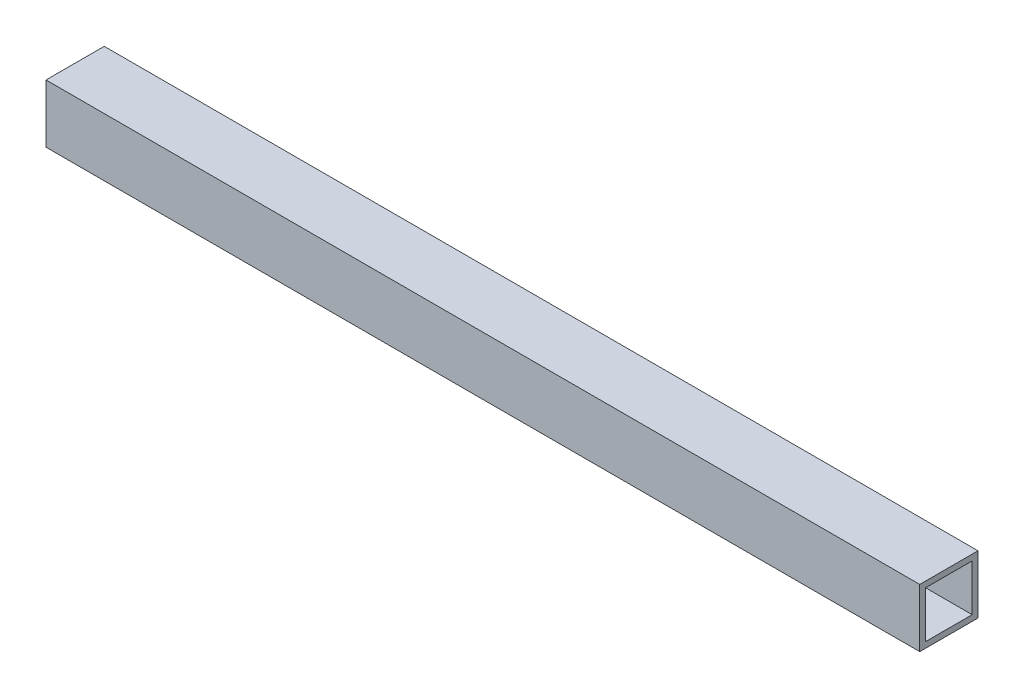
ISO-10303-21;
HEADER;
FILE_DESCRIPTION(('STEP AP214'),'2;1');
FILE_NAME('part.step','',(''),(''),'','','');
FILE_SCHEMA(('AUTOMOTIVE_DESIGN { 1 0 10303 214 1 1 1 1 }'));
ENDSEC;
DATA;
#1=APPLICATION_CONTEXT('core data for automotive mechanical design processes');
#2=APPLICATION_PROTOCOL_DEFINITION('international standard','automotive_design',2000,#1);
#3=PRODUCT_CONTEXT('',#1,'mechanical');
#4=PRODUCT('Part','Part','',(#3));
#5=PRODUCT_RELATED_PRODUCT_CATEGORY('part','',(#4));
#6=PRODUCT_DEFINITION_FORMATION('','',#4);
#7=PRODUCT_DEFINITION_CONTEXT('part definition',#1,'design');
#8=PRODUCT_DEFINITION('design','',#6,#7);
#9=PRODUCT_DEFINITION_SHAPE('','',#8);
#10=(LENGTH_UNIT() NAMED_UNIT(*) SI_UNIT(.MILLI.,.METRE.));
#11=(NAMED_UNIT(*) PLANE_ANGLE_UNIT() SI_UNIT($,.RADIAN.));
#12=(NAMED_UNIT(*) SI_UNIT($,.STERADIAN.) SOLID_ANGLE_UNIT());
#13=UNCERTAINTY_MEASURE_WITH_UNIT(LENGTH_MEASURE(1.E-05),#10,'distance_accuracy_value','');
#14=(GEOMETRIC_REPRESENTATION_CONTEXT(3) GLOBAL_UNCERTAINTY_ASSIGNED_CONTEXT((#13)) GLOBAL_UNIT_ASSIGNED_CONTEXT((#10,
#11,#12)) REPRESENTATION_CONTEXT('',''));
#15=CARTESIAN_POINT('',(0.,0.,0.));
#16=DIRECTION('',(0.,0.,1.));
#17=DIRECTION('',(1.,0.,0.));
#18=AXIS2_PLACEMENT_3D('',#15,#16,#17);
#19=CARTESIAN_POINT('',(150.,0.,0.));
#20=DIRECTION('',(-1.,0.,0.));
#21=DIRECTION('',(0.,0.,1.));
#22=AXIS2_PLACEMENT_3D('',#19,#20,#21);
#23=PLANE('',#22);
#24=DIRECTION('',(0.,1.,0.));
#25=VECTOR('',#24,1.);
#26=CARTESIAN_POINT('',(150.,-5.,-5.));
#27=LINE('',#26,#25);
#28=CARTESIAN_POINT('',(150.,-5.,-5.));
#29=VERTEX_POINT('',#28);
#30=CARTESIAN_POINT('',(150.,5.,-5.));
#31=VERTEX_POINT('',#30);
#32=EDGE_CURVE('E153',#29,#31,#27,.T.);
#33=ORIENTED_EDGE('',*,*,#32,.T.);
#34=DIRECTION('',(0.,0.,1.));
#35=VECTOR('',#34,1.);
#36=CARTESIAN_POINT('',(150.,5.,5.));
#37=LINE('',#36,#35);
#38=CARTESIAN_POINT('',(150.,5.,5.));
#39=VERTEX_POINT('',#38);
#40=EDGE_CURVE('E157',#31,#39,#37,.T.);
#41=ORIENTED_EDGE('',*,*,#40,.T.);
#42=DIRECTION('',(0.,-1.,0.));
#43=VECTOR('',#42,1.);
#44=CARTESIAN_POINT('',(150.,-5.,5.));
#45=LINE('',#44,#43);
#46=CARTESIAN_POINT('',(150.,-5.,5.));
#47=VERTEX_POINT('',#46);
#48=EDGE_CURVE('E161',#39,#47,#45,.T.);
#49=ORIENTED_EDGE('',*,*,#48,.T.);
#50=DIRECTION('',(0.,0.,-1.));
#51=VECTOR('',#50,1.);
#52=CARTESIAN_POINT('',(150.,-5.,5.));
#53=LINE('',#52,#51);
#54=EDGE_CURVE('E164',#47,#29,#53,.T.);
#55=ORIENTED_EDGE('',*,*,#54,.T.);
#56=EDGE_LOOP('',(#33,#41,#49,#55));
#57=FACE_BOUND('',#56,.T.);
#58=DIRECTION('',(0.,-1.,0.));
#59=VECTOR('',#58,1.);
#60=CARTESIAN_POINT('',(150.,-4.,4.));
#61=LINE('',#60,#59);
#62=CARTESIAN_POINT('',(150.,4.,4.));
#63=VERTEX_POINT('',#62);
#64=CARTESIAN_POINT('',(150.,-4.,4.));
#65=VERTEX_POINT('',#64);
#66=EDGE_CURVE('E105',#63,#65,#61,.T.);
#67=ORIENTED_EDGE('',*,*,#66,.F.);
#68=DIRECTION('',(0.,0.,1.));
#69=VECTOR('',#68,1.);
#70=CARTESIAN_POINT('',(150.,4.,4.));
#71=LINE('',#70,#69);
#72=CARTESIAN_POINT('',(150.,4.,-4.));
#73=VERTEX_POINT('',#72);
#74=EDGE_CURVE('E131',#73,#63,#71,.T.);
#75=ORIENTED_EDGE('',*,*,#74,.F.);
#76=DIRECTION('',(0.,1.,0.));
#77=VECTOR('',#76,1.);
#78=CARTESIAN_POINT('',(150.,-4.,-4.));
#79=LINE('',#78,#77);
#80=CARTESIAN_POINT('',(150.,-4.,-4.));
#81=VERTEX_POINT('',#80);
#82=EDGE_CURVE('E127',#81,#73,#79,.T.);
#83=ORIENTED_EDGE('',*,*,#82,.F.);
#84=DIRECTION('',(0.,0.,-1.));
#85=VECTOR('',#84,1.);
#86=CARTESIAN_POINT('',(150.,-4.,4.));
#87=LINE('',#86,#85);
#88=EDGE_CURVE('E114',#65,#81,#87,.T.);
#89=ORIENTED_EDGE('',*,*,#88,.F.);
#90=EDGE_LOOP('',(#67,#75,#83,#89));
#91=FACE_BOUND('',#90,.T.);
#92=ADVANCED_FACE('F39',(#57,#91),#23,.F.);
#93=CARTESIAN_POINT('',(0.,0.,0.));
#94=DIRECTION('',(-1.,0.,0.));
#95=DIRECTION('',(0.,0.,1.));
#96=AXIS2_PLACEMENT_3D('',#93,#94,#95);
#97=PLANE('',#96);
#98=DIRECTION('',(0.,1.,0.));
#99=VECTOR('',#98,1.);
#100=CARTESIAN_POINT('',(0.,-5.,-5.));
#101=LINE('',#100,#99);
#102=CARTESIAN_POINT('',(0.,-5.,-5.));
#103=VERTEX_POINT('',#102);
#104=CARTESIAN_POINT('',(0.,5.,-5.));
#105=VERTEX_POINT('',#104);
#106=EDGE_CURVE('E123',#103,#105,#101,.T.);
#107=ORIENTED_EDGE('',*,*,#106,.F.);
#108=DIRECTION('',(0.,0.,-1.));
#109=VECTOR('',#108,1.);
#110=CARTESIAN_POINT('',(0.,-5.,5.));
#111=LINE('',#110,#109);
#112=CARTESIAN_POINT('',(0.,-5.,5.));
#113=VERTEX_POINT('',#112);
#114=EDGE_CURVE('E158',#113,#103,#111,.T.);
#115=ORIENTED_EDGE('',*,*,#114,.F.);
#116=DIRECTION('',(0.,-1.,0.));
#117=VECTOR('',#116,1.);
#118=CARTESIAN_POINT('',(0.,-5.,5.));
#119=LINE('',#118,#117);
#120=CARTESIAN_POINT('',(0.,5.,5.));
#121=VERTEX_POINT('',#120);
#122=EDGE_CURVE('E174',#121,#113,#119,.T.);
#123=ORIENTED_EDGE('',*,*,#122,.F.);
#124=DIRECTION('',(0.,0.,1.));
#125=VECTOR('',#124,1.);
#126=CARTESIAN_POINT('',(0.,5.,5.));
#127=LINE('',#126,#125);
#128=EDGE_CURVE('E171',#105,#121,#127,.T.);
#129=ORIENTED_EDGE('',*,*,#128,.F.);
#130=EDGE_LOOP('',(#107,#115,#123,#129));
#131=FACE_BOUND('',#130,.T.);
#132=DIRECTION('',(0.,0.,1.));
#133=VECTOR('',#132,1.);
#134=CARTESIAN_POINT('',(0.,4.,4.));
#135=LINE('',#134,#133);
#136=CARTESIAN_POINT('',(0.,4.,-4.));
#137=VERTEX_POINT('',#136);
#138=CARTESIAN_POINT('',(0.,4.,4.));
#139=VERTEX_POINT('',#138);
#140=EDGE_CURVE('E115',#137,#139,#135,.T.);
#141=ORIENTED_EDGE('',*,*,#140,.T.);
#142=DIRECTION('',(0.,-1.,0.));
#143=VECTOR('',#142,1.);
#144=CARTESIAN_POINT('',(0.,-4.,4.));
#145=LINE('',#144,#143);
#146=CARTESIAN_POINT('',(0.,-4.,4.));
#147=VERTEX_POINT('',#146);
#148=EDGE_CURVE('E63',#139,#147,#145,.T.);
#149=ORIENTED_EDGE('',*,*,#148,.T.);
#150=DIRECTION('',(0.,0.,-1.));
#151=VECTOR('',#150,1.);
#152=CARTESIAN_POINT('',(0.,-4.,4.));
#153=LINE('',#152,#151);
#154=CARTESIAN_POINT('',(0.,-4.,-4.));
#155=VERTEX_POINT('',#154);
#156=EDGE_CURVE('E121',#147,#155,#153,.T.);
#157=ORIENTED_EDGE('',*,*,#156,.T.);
#158=DIRECTION('',(0.,1.,0.));
#159=VECTOR('',#158,1.);
#160=CARTESIAN_POINT('',(0.,-4.,-4.));
#161=LINE('',#160,#159);
#162=EDGE_CURVE('E140',#155,#137,#161,.T.);
#163=ORIENTED_EDGE('',*,*,#162,.T.);
#164=EDGE_LOOP('',(#141,#149,#157,#163));
#165=FACE_BOUND('',#164,.T.);
#166=ADVANCED_FACE('F197',(#131,#165),#97,.T.);
#167=CARTESIAN_POINT('',(150.,-5.,-5.));
#168=DIRECTION('',(0.,0.,1.));
#169=DIRECTION('',(1.,0.,0.));
#170=AXIS2_PLACEMENT_3D('',#167,#168,#169);
#171=PLANE('',#170);
#172=ORIENTED_EDGE('',*,*,#106,.T.);
#173=DIRECTION('',(-1.,0.,0.));
#174=VECTOR('',#173,1.);
#175=CARTESIAN_POINT('',(150.,5.,-5.));
#176=LINE('',#175,#174);
#177=EDGE_CURVE('E11',#31,#105,#176,.T.);
#178=ORIENTED_EDGE('',*,*,#177,.F.);
#179=ORIENTED_EDGE('',*,*,#32,.F.);
#180=DIRECTION('',(-1.,0.,0.));
#181=VECTOR('',#180,1.);
#182=CARTESIAN_POINT('',(150.,-5.,-5.));
#183=LINE('',#182,#181);
#184=EDGE_CURVE('E167',#29,#103,#183,.T.);
#185=ORIENTED_EDGE('',*,*,#184,.T.);
#186=EDGE_LOOP('',(#172,#178,#179,#185));
#187=FACE_BOUND('',#186,.T.);
#188=ADVANCED_FACE('F41',(#187),#171,.F.);
#189=CARTESIAN_POINT('',(150.,5.,5.));
#190=DIRECTION('',(0.,-1.,0.));
#191=DIRECTION('',(0.,0.,-1.));
#192=AXIS2_PLACEMENT_3D('',#189,#190,#191);
#193=PLANE('',#192);
#194=ORIENTED_EDGE('',*,*,#128,.T.);
#195=DIRECTION('',(-1.,0.,0.));
#196=VECTOR('',#195,1.);
#197=CARTESIAN_POINT('',(150.,5.,5.));
#198=LINE('',#197,#196);
#199=EDGE_CURVE('E48',#39,#121,#198,.T.);
#200=ORIENTED_EDGE('',*,*,#199,.F.);
#201=ORIENTED_EDGE('',*,*,#40,.F.);
#202=ORIENTED_EDGE('',*,*,#177,.T.);
#203=EDGE_LOOP('',(#194,#200,#201,#202));
#204=FACE_BOUND('',#203,.T.);
#205=ADVANCED_FACE('F207',(#204),#193,.F.);
#206=CARTESIAN_POINT('',(150.,-5.,5.));
#207=DIRECTION('',(0.,0.,-1.));
#208=DIRECTION('',(-1.,0.,0.));
#209=AXIS2_PLACEMENT_3D('',#206,#207,#208);
#210=PLANE('',#209);
#211=ORIENTED_EDGE('',*,*,#122,.T.);
#212=DIRECTION('',(-1.,0.,0.));
#213=VECTOR('',#212,1.);
#214=CARTESIAN_POINT('',(150.,-5.,5.));
#215=LINE('',#214,#213);
#216=EDGE_CURVE('E182',#47,#113,#215,.T.);
#217=ORIENTED_EDGE('',*,*,#216,.F.);
#218=ORIENTED_EDGE('',*,*,#48,.F.);
#219=ORIENTED_EDGE('',*,*,#199,.T.);
#220=EDGE_LOOP('',(#211,#217,#218,#219));
#221=FACE_BOUND('',#220,.T.);
#222=ADVANCED_FACE('F191',(#221),#210,.F.);
#223=CARTESIAN_POINT('',(150.,-5.,5.));
#224=DIRECTION('',(0.,1.,0.));
#225=DIRECTION('',(0.,0.,1.));
#226=AXIS2_PLACEMENT_3D('',#223,#224,#225);
#227=PLANE('',#226);
#228=ORIENTED_EDGE('',*,*,#114,.T.);
#229=ORIENTED_EDGE('',*,*,#184,.F.);
#230=ORIENTED_EDGE('',*,*,#54,.F.);
#231=ORIENTED_EDGE('',*,*,#216,.T.);
#232=EDGE_LOOP('',(#228,#229,#230,#231));
#233=FACE_BOUND('',#232,.T.);
#234=ADVANCED_FACE('F201',(#233),#227,.F.);
#235=CARTESIAN_POINT('',(150.,-4.,4.));
#236=DIRECTION('',(0.,0.,-1.));
#237=DIRECTION('',(-1.,0.,0.));
#238=AXIS2_PLACEMENT_3D('',#235,#236,#237);
#239=PLANE('',#238);
#240=ORIENTED_EDGE('',*,*,#148,.F.);
#241=DIRECTION('',(-1.,0.,0.));
#242=VECTOR('',#241,1.);
#243=CARTESIAN_POINT('',(150.,4.,4.));
#244=LINE('',#243,#242);
#245=EDGE_CURVE('E109',#63,#139,#244,.T.);
#246=ORIENTED_EDGE('',*,*,#245,.F.);
#247=ORIENTED_EDGE('',*,*,#66,.T.);
#248=DIRECTION('',(-1.,0.,0.));
#249=VECTOR('',#248,1.);
#250=CARTESIAN_POINT('',(150.,-4.,4.));
#251=LINE('',#250,#249);
#252=EDGE_CURVE('E108',#65,#147,#251,.T.);
#253=ORIENTED_EDGE('',*,*,#252,.T.);
#254=EDGE_LOOP('',(#240,#246,#247,#253));
#255=FACE_BOUND('',#254,.T.);
#256=ADVANCED_FACE('F107',(#255),#239,.T.);
#257=CARTESIAN_POINT('',(150.,-4.,4.));
#258=DIRECTION('',(0.,1.,0.));
#259=DIRECTION('',(0.,0.,1.));
#260=AXIS2_PLACEMENT_3D('',#257,#258,#259);
#261=PLANE('',#260);
#262=ORIENTED_EDGE('',*,*,#156,.F.);
#263=ORIENTED_EDGE('',*,*,#252,.F.);
#264=ORIENTED_EDGE('',*,*,#88,.T.);
#265=DIRECTION('',(-1.,0.,0.));
#266=VECTOR('',#265,1.);
#267=CARTESIAN_POINT('',(150.,-4.,-4.));
#268=LINE('',#267,#266);
#269=EDGE_CURVE('E124',#81,#155,#268,.T.);
#270=ORIENTED_EDGE('',*,*,#269,.T.);
#271=EDGE_LOOP('',(#262,#263,#264,#270));
#272=FACE_BOUND('',#271,.T.);
#273=ADVANCED_FACE('F118',(#272),#261,.T.);
#274=CARTESIAN_POINT('',(150.,-4.,-4.));
#275=DIRECTION('',(0.,0.,1.));
#276=DIRECTION('',(1.,0.,0.));
#277=AXIS2_PLACEMENT_3D('',#274,#275,#276);
#278=PLANE('',#277);
#279=ORIENTED_EDGE('',*,*,#162,.F.);
#280=ORIENTED_EDGE('',*,*,#269,.F.);
#281=ORIENTED_EDGE('',*,*,#82,.T.);
#282=DIRECTION('',(-1.,0.,0.));
#283=VECTOR('',#282,1.);
#284=CARTESIAN_POINT('',(150.,4.,-4.));
#285=LINE('',#284,#283);
#286=EDGE_CURVE('E55',#73,#137,#285,.T.);
#287=ORIENTED_EDGE('',*,*,#286,.T.);
#288=EDGE_LOOP('',(#279,#280,#281,#287));
#289=FACE_BOUND('',#288,.T.);
#290=ADVANCED_FACE('F230',(#289),#278,.T.);
#291=CARTESIAN_POINT('',(150.,4.,4.));
#292=DIRECTION('',(0.,-1.,0.));
#293=DIRECTION('',(0.,0.,-1.));
#294=AXIS2_PLACEMENT_3D('',#291,#292,#293);
#295=PLANE('',#294);
#296=ORIENTED_EDGE('',*,*,#140,.F.);
#297=ORIENTED_EDGE('',*,*,#286,.F.);
#298=ORIENTED_EDGE('',*,*,#74,.T.);
#299=ORIENTED_EDGE('',*,*,#245,.T.);
#300=EDGE_LOOP('',(#296,#297,#298,#299));
#301=FACE_BOUND('',#300,.T.);
#302=ADVANCED_FACE('F234',(#301),#295,.T.);
#303=CLOSED_SHELL('',(#92,#166,#188,#205,#222,#234,#256,#273,#290,#302));
#304=MANIFOLD_SOLID_BREP('B2',#303);
#305=ADVANCED_BREP_SHAPE_REPRESENTATION('',(#18,#304),#14);
#306=SHAPE_DEFINITION_REPRESENTATION(#9,#305);
ENDSEC;
END-ISO-10303-21;
